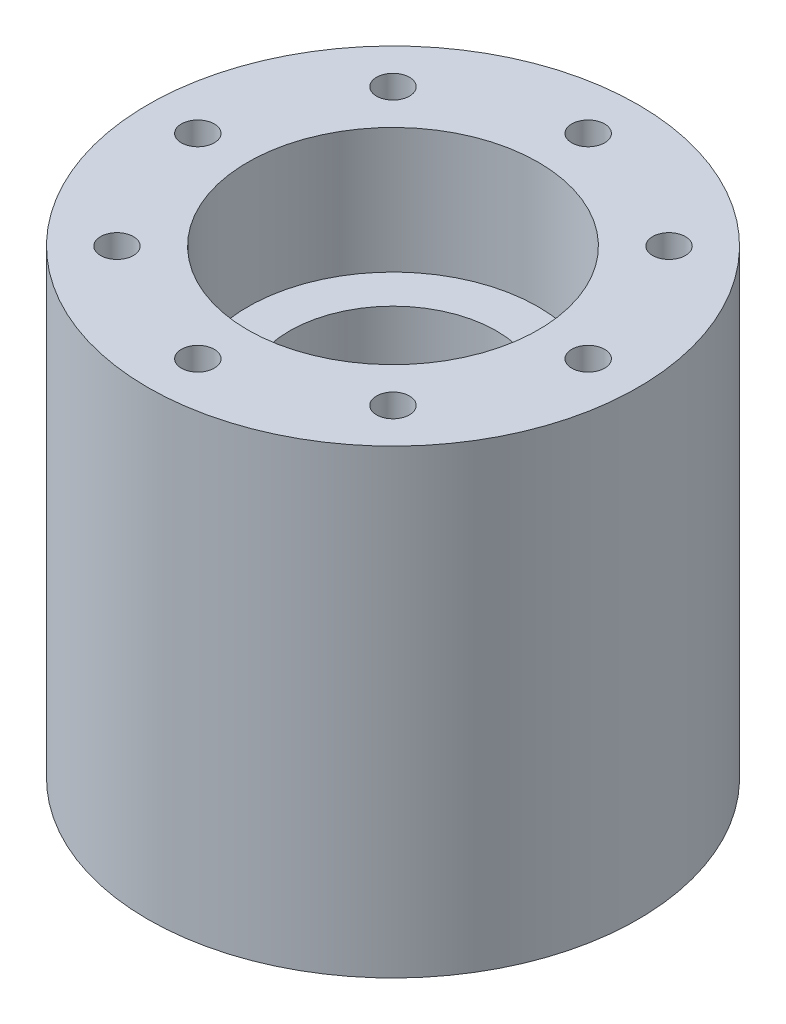
ISO-10303-21;
HEADER;
FILE_DESCRIPTION(('STEP AP214'),'2;1');
FILE_NAME('part.step','',(''),(''),'','','');
FILE_SCHEMA(('AUTOMOTIVE_DESIGN { 1 0 10303 214 1 1 1 1 }'));
ENDSEC;
DATA;
#1=APPLICATION_CONTEXT('core data for automotive mechanical design processes');
#2=APPLICATION_PROTOCOL_DEFINITION('international standard','automotive_design',2000,#1);
#3=PRODUCT_CONTEXT('',#1,'mechanical');
#4=PRODUCT('Part','Part','',(#3));
#5=PRODUCT_RELATED_PRODUCT_CATEGORY('part','',(#4));
#6=PRODUCT_DEFINITION_FORMATION('','',#4);
#7=PRODUCT_DEFINITION_CONTEXT('part definition',#1,'design');
#8=PRODUCT_DEFINITION('design','',#6,#7);
#9=PRODUCT_DEFINITION_SHAPE('','',#8);
#10=(LENGTH_UNIT() NAMED_UNIT(*) SI_UNIT(.MILLI.,.METRE.));
#11=(NAMED_UNIT(*) PLANE_ANGLE_UNIT() SI_UNIT($,.RADIAN.));
#12=(NAMED_UNIT(*) SI_UNIT($,.STERADIAN.) SOLID_ANGLE_UNIT());
#13=UNCERTAINTY_MEASURE_WITH_UNIT(LENGTH_MEASURE(1.E-05),#10,'distance_accuracy_value','');
#14=(GEOMETRIC_REPRESENTATION_CONTEXT(3) GLOBAL_UNCERTAINTY_ASSIGNED_CONTEXT((#13)) GLOBAL_UNIT_ASSIGNED_CONTEXT((#10,
#11,#12)) REPRESENTATION_CONTEXT('',''));
#15=CARTESIAN_POINT('',(0.,0.,0.));
#16=DIRECTION('',(0.,0.,1.));
#17=DIRECTION('',(1.,0.,0.));
#18=AXIS2_PLACEMENT_3D('',#15,#16,#17);
#19=CARTESIAN_POINT('',(0.,35.03125,0.));
#20=DIRECTION('',(0.,-1.,0.));
#21=DIRECTION('',(0.,0.,-1.));
#22=AXIS2_PLACEMENT_3D('',#19,#20,#21);
#23=CYLINDRICAL_SURFACE('',#22,18.6375);
#24=CARTESIAN_POINT('',(0.,35.03125,0.));
#25=DIRECTION('',(0.,1.,0.));
#26=DIRECTION('',(0.,0.,1.));
#27=AXIS2_PLACEMENT_3D('',#24,#25,#26);
#28=CIRCLE('',#27,18.6375);
#29=CARTESIAN_POINT('',(0.,35.03125,18.6375));
#30=VERTEX_POINT('',#29);
#31=EDGE_CURVE('E11',#30,#30,#28,.T.);
#32=ORIENTED_EDGE('',*,*,#31,.F.);
#33=EDGE_LOOP('',(#32));
#34=FACE_BOUND('',#33,.T.);
#35=CARTESIAN_POINT('',(0.,0.,0.));
#36=DIRECTION('',(0.,1.,0.));
#37=DIRECTION('',(0.,0.,1.));
#38=AXIS2_PLACEMENT_3D('',#35,#36,#37);
#39=CIRCLE('',#38,18.6375);
#40=CARTESIAN_POINT('',(0.,0.,18.6375));
#41=VERTEX_POINT('',#40);
#42=EDGE_CURVE('E42',#41,#41,#39,.T.);
#43=ORIENTED_EDGE('',*,*,#42,.T.);
#44=EDGE_LOOP('',(#43));
#45=FACE_BOUND('',#44,.T.);
#46=ADVANCED_FACE('F34',(#34,#45),#23,.T.);
#47=CARTESIAN_POINT('',(0.,35.03125,0.));
#48=DIRECTION('',(0.,1.,0.));
#49=DIRECTION('',(0.,0.,1.));
#50=AXIS2_PLACEMENT_3D('',#47,#48,#49);
#51=PLANE('',#50);
#52=CARTESIAN_POINT('',(0.,35.03125,14.843252));
#53=DIRECTION('',(0.,1.,0.));
#54=DIRECTION('',(0.,0.,1.));
#55=AXIS2_PLACEMENT_3D('',#52,#53,#54);
#56=CIRCLE('',#55,1.24999999999999);
#57=CARTESIAN_POINT('',(0.,35.03125,16.093252));
#58=VERTEX_POINT('',#57);
#59=EDGE_CURVE('E103',#58,#58,#56,.T.);
#60=ORIENTED_EDGE('',*,*,#59,.F.);
#61=EDGE_LOOP('',(#60));
#62=FACE_BOUND('',#61,.T.);
#63=CARTESIAN_POINT('',(10.4957641440608,35.03125,10.4957641440608));
#64=DIRECTION('',(0.,1.,0.));
#65=DIRECTION('',(0.,0.,1.));
#66=AXIS2_PLACEMENT_3D('',#63,#64,#65);
#67=CIRCLE('',#66,1.24999999999999);
#68=CARTESIAN_POINT('',(10.4957641440608,35.03125,11.7457641440608));
#69=VERTEX_POINT('',#68);
#70=EDGE_CURVE('E102',#69,#69,#67,.T.);
#71=ORIENTED_EDGE('',*,*,#70,.F.);
#72=EDGE_LOOP('',(#71));
#73=FACE_BOUND('',#72,.T.);
#74=CARTESIAN_POINT('',(14.843252,35.03125,0.));
#75=DIRECTION('',(0.,1.,0.));
#76=DIRECTION('',(0.,0.,1.));
#77=AXIS2_PLACEMENT_3D('',#74,#75,#76);
#78=CIRCLE('',#77,1.24999999999999);
#79=CARTESIAN_POINT('',(14.843252,35.03125,1.24999999999999));
#80=VERTEX_POINT('',#79);
#81=EDGE_CURVE('E113',#80,#80,#78,.T.);
#82=ORIENTED_EDGE('',*,*,#81,.F.);
#83=EDGE_LOOP('',(#82));
#84=FACE_BOUND('',#83,.T.);
#85=CARTESIAN_POINT('',(10.4957641440608,35.03125,-10.4957641440608));
#86=DIRECTION('',(0.,1.,0.));
#87=DIRECTION('',(0.,0.,1.));
#88=AXIS2_PLACEMENT_3D('',#85,#86,#87);
#89=CIRCLE('',#88,1.24999999999999);
#90=CARTESIAN_POINT('',(10.4957641440608,35.03125,-9.2457641440608));
#91=VERTEX_POINT('',#90);
#92=EDGE_CURVE('E119',#91,#91,#89,.T.);
#93=ORIENTED_EDGE('',*,*,#92,.F.);
#94=EDGE_LOOP('',(#93));
#95=FACE_BOUND('',#94,.T.);
#96=CARTESIAN_POINT('',(0.,35.03125,-14.843252));
#97=DIRECTION('',(0.,1.,0.));
#98=DIRECTION('',(0.,0.,1.));
#99=AXIS2_PLACEMENT_3D('',#96,#97,#98);
#100=CIRCLE('',#99,1.24999999999999);
#101=CARTESIAN_POINT('',(0.,35.03125,-13.593252));
#102=VERTEX_POINT('',#101);
#103=EDGE_CURVE('E125',#102,#102,#100,.T.);
#104=ORIENTED_EDGE('',*,*,#103,.F.);
#105=EDGE_LOOP('',(#104));
#106=FACE_BOUND('',#105,.T.);
#107=CARTESIAN_POINT('',(-10.4957641440608,35.03125,-10.4957641440608));
#108=DIRECTION('',(0.,1.,0.));
#109=DIRECTION('',(0.,0.,1.));
#110=AXIS2_PLACEMENT_3D('',#107,#108,#109);
#111=CIRCLE('',#110,1.24999999999999);
#112=CARTESIAN_POINT('',(-10.4957641440608,35.03125,-9.24576414406079));
#113=VERTEX_POINT('',#112);
#114=EDGE_CURVE('E131',#113,#113,#111,.T.);
#115=ORIENTED_EDGE('',*,*,#114,.F.);
#116=EDGE_LOOP('',(#115));
#117=FACE_BOUND('',#116,.T.);
#118=CARTESIAN_POINT('',(-14.843252,35.03125,0.));
#119=DIRECTION('',(0.,1.,0.));
#120=DIRECTION('',(0.,0.,1.));
#121=AXIS2_PLACEMENT_3D('',#118,#119,#120);
#122=CIRCLE('',#121,1.24999999999999);
#123=CARTESIAN_POINT('',(-14.843252,35.03125,1.24999999999999));
#124=VERTEX_POINT('',#123);
#125=EDGE_CURVE('E137',#124,#124,#122,.T.);
#126=ORIENTED_EDGE('',*,*,#125,.F.);
#127=EDGE_LOOP('',(#126));
#128=FACE_BOUND('',#127,.T.);
#129=CARTESIAN_POINT('',(-10.4957641440608,35.03125,10.4957641440608));
#130=DIRECTION('',(0.,1.,0.));
#131=DIRECTION('',(0.,0.,1.));
#132=AXIS2_PLACEMENT_3D('',#129,#130,#131);
#133=CIRCLE('',#132,1.24999999999999);
#134=CARTESIAN_POINT('',(-10.4957641440608,35.03125,11.7457641440608));
#135=VERTEX_POINT('',#134);
#136=EDGE_CURVE('E143',#135,#135,#133,.T.);
#137=ORIENTED_EDGE('',*,*,#136,.F.);
#138=EDGE_LOOP('',(#137));
#139=FACE_BOUND('',#138,.T.);
#140=CARTESIAN_POINT('',(0.,35.03125,0.));
#141=DIRECTION('',(0.,1.,0.));
#142=DIRECTION('',(0.,0.,1.));
#143=AXIS2_PLACEMENT_3D('',#140,#141,#142);
#144=CIRCLE('',#143,11.049);
#145=CARTESIAN_POINT('',(0.,35.03125,11.049));
#146=VERTEX_POINT('',#145);
#147=EDGE_CURVE('E200',#146,#146,#144,.T.);
#148=ORIENTED_EDGE('',*,*,#147,.F.);
#149=EDGE_LOOP('',(#148));
#150=FACE_BOUND('',#149,.T.);
#151=ORIENTED_EDGE('',*,*,#31,.T.);
#152=EDGE_LOOP('',(#151));
#153=FACE_BOUND('',#152,.T.);
#154=ADVANCED_FACE('F218',(#62,#73,#84,#95,#106,#117,#128,#139,#150,#153),#51,.T.);
#155=CARTESIAN_POINT('',(0.,0.,0.));
#156=DIRECTION('',(0.,1.,0.));
#157=DIRECTION('',(0.,0.,1.));
#158=AXIS2_PLACEMENT_3D('',#155,#156,#157);
#159=PLANE('',#158);
#160=CARTESIAN_POINT('',(0.,0.,14.843252));
#161=DIRECTION('',(0.,-1.,0.));
#162=DIRECTION('',(0.,0.,-1.));
#163=AXIS2_PLACEMENT_3D('',#160,#161,#162);
#164=CIRCLE('',#163,1.25);
#165=CARTESIAN_POINT('',(0.,0.,13.593252));
#166=VERTEX_POINT('',#165);
#167=EDGE_CURVE('E149',#166,#166,#164,.T.);
#168=ORIENTED_EDGE('',*,*,#167,.F.);
#169=EDGE_LOOP('',(#168));
#170=FACE_BOUND('',#169,.T.);
#171=CARTESIAN_POINT('',(10.4957641440608,0.,10.4957641440608));
#172=DIRECTION('',(0.,-1.,0.));
#173=DIRECTION('',(0.,0.,-1.));
#174=AXIS2_PLACEMENT_3D('',#171,#172,#173);
#175=CIRCLE('',#174,1.25);
#176=CARTESIAN_POINT('',(10.4957641440608,0.,9.24576414406078));
#177=VERTEX_POINT('',#176);
#178=EDGE_CURVE('E155',#177,#177,#175,.T.);
#179=ORIENTED_EDGE('',*,*,#178,.F.);
#180=EDGE_LOOP('',(#179));
#181=FACE_BOUND('',#180,.T.);
#182=CARTESIAN_POINT('',(14.843252,0.,0.));
#183=DIRECTION('',(0.,-1.,0.));
#184=DIRECTION('',(0.,0.,-1.));
#185=AXIS2_PLACEMENT_3D('',#182,#183,#184);
#186=CIRCLE('',#185,1.25);
#187=CARTESIAN_POINT('',(14.843252,0.,-1.25));
#188=VERTEX_POINT('',#187);
#189=EDGE_CURVE('E161',#188,#188,#186,.T.);
#190=ORIENTED_EDGE('',*,*,#189,.F.);
#191=EDGE_LOOP('',(#190));
#192=FACE_BOUND('',#191,.T.);
#193=CARTESIAN_POINT('',(10.4957641440608,0.,-10.4957641440608));
#194=DIRECTION('',(0.,-1.,0.));
#195=DIRECTION('',(0.,0.,-1.));
#196=AXIS2_PLACEMENT_3D('',#193,#194,#195);
#197=CIRCLE('',#196,1.25);
#198=CARTESIAN_POINT('',(10.4957641440608,0.,-11.7457641440608));
#199=VERTEX_POINT('',#198);
#200=EDGE_CURVE('E167',#199,#199,#197,.T.);
#201=ORIENTED_EDGE('',*,*,#200,.F.);
#202=EDGE_LOOP('',(#201));
#203=FACE_BOUND('',#202,.T.);
#204=CARTESIAN_POINT('',(0.,0.,-14.843252));
#205=DIRECTION('',(0.,-1.,0.));
#206=DIRECTION('',(0.,0.,-1.));
#207=AXIS2_PLACEMENT_3D('',#204,#205,#206);
#208=CIRCLE('',#207,1.25);
#209=CARTESIAN_POINT('',(0.,0.,-16.093252));
#210=VERTEX_POINT('',#209);
#211=EDGE_CURVE('E173',#210,#210,#208,.T.);
#212=ORIENTED_EDGE('',*,*,#211,.F.);
#213=EDGE_LOOP('',(#212));
#214=FACE_BOUND('',#213,.T.);
#215=CARTESIAN_POINT('',(-10.4957641440608,0.,-10.4957641440608));
#216=DIRECTION('',(0.,-1.,0.));
#217=DIRECTION('',(0.,0.,-1.));
#218=AXIS2_PLACEMENT_3D('',#215,#216,#217);
#219=CIRCLE('',#218,1.25);
#220=CARTESIAN_POINT('',(-10.4957641440608,0.,-11.7457641440608));
#221=VERTEX_POINT('',#220);
#222=EDGE_CURVE('E179',#221,#221,#219,.T.);
#223=ORIENTED_EDGE('',*,*,#222,.F.);
#224=EDGE_LOOP('',(#223));
#225=FACE_BOUND('',#224,.T.);
#226=CARTESIAN_POINT('',(-14.843252,0.,0.));
#227=DIRECTION('',(0.,-1.,0.));
#228=DIRECTION('',(0.,0.,-1.));
#229=AXIS2_PLACEMENT_3D('',#226,#227,#228);
#230=CIRCLE('',#229,1.25);
#231=CARTESIAN_POINT('',(-14.843252,0.,-1.25));
#232=VERTEX_POINT('',#231);
#233=EDGE_CURVE('E185',#232,#232,#230,.T.);
#234=ORIENTED_EDGE('',*,*,#233,.F.);
#235=EDGE_LOOP('',(#234));
#236=FACE_BOUND('',#235,.T.);
#237=CARTESIAN_POINT('',(-10.4957641440608,0.,10.4957641440608));
#238=DIRECTION('',(0.,-1.,0.));
#239=DIRECTION('',(0.,0.,-1.));
#240=AXIS2_PLACEMENT_3D('',#237,#238,#239);
#241=CIRCLE('',#240,1.25);
#242=CARTESIAN_POINT('',(-10.4957641440608,0.,9.24576414406079));
#243=VERTEX_POINT('',#242);
#244=EDGE_CURVE('E191',#243,#243,#241,.T.);
#245=ORIENTED_EDGE('',*,*,#244,.F.);
#246=EDGE_LOOP('',(#245));
#247=FACE_BOUND('',#246,.T.);
#248=CARTESIAN_POINT('',(0.,0.,0.));
#249=DIRECTION('',(0.,-1.,0.));
#250=DIRECTION('',(0.,0.,-1.));
#251=AXIS2_PLACEMENT_3D('',#248,#249,#250);
#252=CIRCLE('',#251,11.049);
#253=CARTESIAN_POINT('',(0.,0.,-11.049));
#254=VERTEX_POINT('',#253);
#255=EDGE_CURVE('E204',#254,#254,#252,.T.);
#256=ORIENTED_EDGE('',*,*,#255,.F.);
#257=EDGE_LOOP('',(#256));
#258=FACE_BOUND('',#257,.T.);
#259=ORIENTED_EDGE('',*,*,#42,.F.);
#260=EDGE_LOOP('',(#259));
#261=FACE_BOUND('',#260,.T.);
#262=ADVANCED_FACE('F215',(#170,#181,#192,#203,#214,#225,#236,#247,#258,#261),#159,.F.);
#263=CARTESIAN_POINT('',(0.,9.525,0.));
#264=DIRECTION('',(0.,-1.,0.));
#265=DIRECTION('',(0.,0.,-1.));
#266=AXIS2_PLACEMENT_3D('',#263,#264,#265);
#267=CYLINDRICAL_SURFACE('',#266,11.049);
#268=CARTESIAN_POINT('',(0.,9.525,0.));
#269=DIRECTION('',(0.,-1.,0.));
#270=DIRECTION('',(0.,0.,-1.));
#271=AXIS2_PLACEMENT_3D('',#268,#269,#270);
#272=CIRCLE('',#271,11.049);
#273=CARTESIAN_POINT('',(0.,9.525,-11.049));
#274=VERTEX_POINT('',#273);
#275=EDGE_CURVE('E207',#274,#274,#272,.T.);
#276=ORIENTED_EDGE('',*,*,#275,.F.);
#277=EDGE_LOOP('',(#276));
#278=FACE_BOUND('',#277,.T.);
#279=ORIENTED_EDGE('',*,*,#255,.T.);
#280=EDGE_LOOP('',(#279));
#281=FACE_BOUND('',#280,.T.);
#282=ADVANCED_FACE('F217',(#278,#281),#267,.F.);
#283=CARTESIAN_POINT('',(0.,9.525,0.));
#284=DIRECTION('',(0.,-1.,0.));
#285=DIRECTION('',(0.,0.,-1.));
#286=AXIS2_PLACEMENT_3D('',#283,#284,#285);
#287=PLANE('',#286);
#288=CARTESIAN_POINT('',(0.,9.525,0.));
#289=DIRECTION('',(0.,-1.,0.));
#290=DIRECTION('',(0.,0.,-1.));
#291=AXIS2_PLACEMENT_3D('',#288,#289,#290);
#292=CIRCLE('',#291,7.874);
#293=CARTESIAN_POINT('',(0.,9.525,-7.874));
#294=VERTEX_POINT('',#293);
#295=EDGE_CURVE('E197',#294,#294,#292,.T.);
#296=ORIENTED_EDGE('',*,*,#295,.F.);
#297=EDGE_LOOP('',(#296));
#298=FACE_BOUND('',#297,.T.);
#299=ORIENTED_EDGE('',*,*,#275,.T.);
#300=EDGE_LOOP('',(#299));
#301=FACE_BOUND('',#300,.T.);
#302=ADVANCED_FACE('F224',(#298,#301),#287,.T.);
#303=CARTESIAN_POINT('',(0.,25.50625,0.));
#304=DIRECTION('',(0.,1.,0.));
#305=DIRECTION('',(0.,0.,1.));
#306=AXIS2_PLACEMENT_3D('',#303,#304,#305);
#307=CYLINDRICAL_SURFACE('',#306,11.049);
#308=CARTESIAN_POINT('',(0.,25.50625,0.));
#309=DIRECTION('',(0.,1.,0.));
#310=DIRECTION('',(0.,0.,1.));
#311=AXIS2_PLACEMENT_3D('',#308,#309,#310);
#312=CIRCLE('',#311,11.049);
#313=CARTESIAN_POINT('',(0.,25.50625,11.049));
#314=VERTEX_POINT('',#313);
#315=EDGE_CURVE('E201',#314,#314,#312,.T.);
#316=ORIENTED_EDGE('',*,*,#315,.F.);
#317=EDGE_LOOP('',(#316));
#318=FACE_BOUND('',#317,.T.);
#319=ORIENTED_EDGE('',*,*,#147,.T.);
#320=EDGE_LOOP('',(#319));
#321=FACE_BOUND('',#320,.T.);
#322=ADVANCED_FACE('F584',(#318,#321),#307,.F.);
#323=CARTESIAN_POINT('',(0.,25.50625,0.));
#324=DIRECTION('',(0.,1.,0.));
#325=DIRECTION('',(0.,0.,1.));
#326=AXIS2_PLACEMENT_3D('',#323,#324,#325);
#327=PLANE('',#326);
#328=CARTESIAN_POINT('',(0.,25.50625,0.));
#329=DIRECTION('',(0.,1.,0.));
#330=DIRECTION('',(0.,0.,1.));
#331=AXIS2_PLACEMENT_3D('',#328,#329,#330);
#332=CIRCLE('',#331,7.874);
#333=CARTESIAN_POINT('',(0.,25.50625,7.874));
#334=VERTEX_POINT('',#333);
#335=EDGE_CURVE('E37',#334,#334,#332,.T.);
#336=ORIENTED_EDGE('',*,*,#335,.F.);
#337=EDGE_LOOP('',(#336));
#338=FACE_BOUND('',#337,.T.);
#339=ORIENTED_EDGE('',*,*,#315,.T.);
#340=EDGE_LOOP('',(#339));
#341=FACE_BOUND('',#340,.T.);
#342=ADVANCED_FACE('F580',(#338,#341),#327,.T.);
#343=CARTESIAN_POINT('',(0.,35.03125,0.));
#344=DIRECTION('',(0.,-1.,0.));
#345=DIRECTION('',(0.,0.,-1.));
#346=AXIS2_PLACEMENT_3D('',#343,#344,#345);
#347=CYLINDRICAL_SURFACE('',#346,7.874);
#348=ORIENTED_EDGE('',*,*,#295,.T.);
#349=EDGE_LOOP('',(#348));
#350=FACE_BOUND('',#349,.T.);
#351=ORIENTED_EDGE('',*,*,#335,.T.);
#352=EDGE_LOOP('',(#351));
#353=FACE_BOUND('',#352,.T.);
#354=ADVANCED_FACE('F578',(#350,#353),#347,.F.);
#355=CARTESIAN_POINT('',(-10.4957641440608,7.50062,10.4957641440608));
#356=DIRECTION('',(0.,-1.,0.));
#357=DIRECTION('',(0.,0.,-1.));
#358=AXIS2_PLACEMENT_3D('',#355,#356,#357);
#359=CONICAL_SURFACE('',#358,1.25,1.02974425867665);
#360=CARTESIAN_POINT('',(-10.4957641440608,8.25169577378445,10.4957641440608));
#361=VERTEX_POINT('',#360);
#362=VERTEX_LOOP('',#361);
#363=FACE_BOUND('',#362,.T.);
#364=CARTESIAN_POINT('',(-10.4957641440608,7.50062,10.4957641440608));
#365=DIRECTION('',(0.,-1.,0.));
#366=DIRECTION('',(0.,0.,-1.));
#367=AXIS2_PLACEMENT_3D('',#364,#365,#366);
#368=CIRCLE('',#367,1.25);
#369=CARTESIAN_POINT('',(-10.4957641440608,7.50062,9.24576414406079));
#370=VERTEX_POINT('',#369);
#371=EDGE_CURVE('E194',#370,#370,#368,.T.);
#372=ORIENTED_EDGE('',*,*,#371,.T.);
#373=EDGE_LOOP('',(#372));
#374=FACE_BOUND('',#373,.T.);
#375=ADVANCED_FACE('F505',(#363,#374),#359,.F.);
#376=CARTESIAN_POINT('',(-10.4957641440608,0.,10.4957641440608));
#377=DIRECTION('',(0.,-1.,0.));
#378=DIRECTION('',(0.,0.,-1.));
#379=AXIS2_PLACEMENT_3D('',#376,#377,#378);
#380=CYLINDRICAL_SURFACE('',#379,1.25);
#381=ORIENTED_EDGE('',*,*,#371,.F.);
#382=EDGE_LOOP('',(#381));
#383=FACE_BOUND('',#382,.T.);
#384=ORIENTED_EDGE('',*,*,#244,.T.);
#385=EDGE_LOOP('',(#384));
#386=FACE_BOUND('',#385,.T.);
#387=ADVANCED_FACE('F501',(#383,#386),#380,.F.);
#388=CARTESIAN_POINT('',(-14.843252,7.50062,0.));
#389=DIRECTION('',(0.,-1.,0.));
#390=DIRECTION('',(0.,0.,-1.));
#391=AXIS2_PLACEMENT_3D('',#388,#389,#390);
#392=CONICAL_SURFACE('',#391,1.25,1.02974425867665);
#393=CARTESIAN_POINT('',(-14.843252,8.25169577378445,0.));
#394=VERTEX_POINT('',#393);
#395=VERTEX_LOOP('',#394);
#396=FACE_BOUND('',#395,.T.);
#397=CARTESIAN_POINT('',(-14.843252,7.50062,0.));
#398=DIRECTION('',(0.,-1.,0.));
#399=DIRECTION('',(0.,0.,-1.));
#400=AXIS2_PLACEMENT_3D('',#397,#398,#399);
#401=CIRCLE('',#400,1.25);
#402=CARTESIAN_POINT('',(-14.843252,7.50062,-1.25));
#403=VERTEX_POINT('',#402);
#404=EDGE_CURVE('E188',#403,#403,#401,.T.);
#405=ORIENTED_EDGE('',*,*,#404,.T.);
#406=EDGE_LOOP('',(#405));
#407=FACE_BOUND('',#406,.T.);
#408=ADVANCED_FACE('F493',(#396,#407),#392,.F.);
#409=CARTESIAN_POINT('',(-14.843252,0.,0.));
#410=DIRECTION('',(0.,-1.,0.));
#411=DIRECTION('',(0.,0.,-1.));
#412=AXIS2_PLACEMENT_3D('',#409,#410,#411);
#413=CYLINDRICAL_SURFACE('',#412,1.25);
#414=ORIENTED_EDGE('',*,*,#404,.F.);
#415=EDGE_LOOP('',(#414));
#416=FACE_BOUND('',#415,.T.);
#417=ORIENTED_EDGE('',*,*,#233,.T.);
#418=EDGE_LOOP('',(#417));
#419=FACE_BOUND('',#418,.T.);
#420=ADVANCED_FACE('F488',(#416,#419),#413,.F.);
#421=CARTESIAN_POINT('',(-10.4957641440608,7.50062,-10.4957641440608));
#422=DIRECTION('',(0.,-1.,0.));
#423=DIRECTION('',(0.,0.,-1.));
#424=AXIS2_PLACEMENT_3D('',#421,#422,#423);
#425=CONICAL_SURFACE('',#424,1.25,1.02974425867665);
#426=CARTESIAN_POINT('',(-10.4957641440608,8.25169577378445,-10.4957641440608));
#427=VERTEX_POINT('',#426);
#428=VERTEX_LOOP('',#427);
#429=FACE_BOUND('',#428,.T.);
#430=CARTESIAN_POINT('',(-10.4957641440608,7.50062,-10.4957641440608));
#431=DIRECTION('',(0.,-1.,0.));
#432=DIRECTION('',(0.,0.,-1.));
#433=AXIS2_PLACEMENT_3D('',#430,#431,#432);
#434=CIRCLE('',#433,1.25);
#435=CARTESIAN_POINT('',(-10.4957641440608,7.50062,-11.7457641440608));
#436=VERTEX_POINT('',#435);
#437=EDGE_CURVE('E182',#436,#436,#434,.T.);
#438=ORIENTED_EDGE('',*,*,#437,.T.);
#439=EDGE_LOOP('',(#438));
#440=FACE_BOUND('',#439,.T.);
#441=ADVANCED_FACE('F480',(#429,#440),#425,.F.);
#442=CARTESIAN_POINT('',(-10.4957641440608,0.,-10.4957641440608));
#443=DIRECTION('',(0.,-1.,0.));
#444=DIRECTION('',(0.,0.,-1.));
#445=AXIS2_PLACEMENT_3D('',#442,#443,#444);
#446=CYLINDRICAL_SURFACE('',#445,1.25);
#447=ORIENTED_EDGE('',*,*,#437,.F.);
#448=EDGE_LOOP('',(#447));
#449=FACE_BOUND('',#448,.T.);
#450=ORIENTED_EDGE('',*,*,#222,.T.);
#451=EDGE_LOOP('',(#450));
#452=FACE_BOUND('',#451,.T.);
#453=ADVANCED_FACE('F475',(#449,#452),#446,.F.);
#454=CARTESIAN_POINT('',(0.,7.50062,-14.843252));
#455=DIRECTION('',(0.,-1.,0.));
#456=DIRECTION('',(0.,0.,-1.));
#457=AXIS2_PLACEMENT_3D('',#454,#455,#456);
#458=CONICAL_SURFACE('',#457,1.25,1.02974425867665);
#459=CARTESIAN_POINT('',(0.,8.25169577378445,-14.843252));
#460=VERTEX_POINT('',#459);
#461=VERTEX_LOOP('',#460);
#462=FACE_BOUND('',#461,.T.);
#463=CARTESIAN_POINT('',(0.,7.50062,-14.843252));
#464=DIRECTION('',(0.,-1.,0.));
#465=DIRECTION('',(0.,0.,-1.));
#466=AXIS2_PLACEMENT_3D('',#463,#464,#465);
#467=CIRCLE('',#466,1.25);
#468=CARTESIAN_POINT('',(0.,7.50062,-16.093252));
#469=VERTEX_POINT('',#468);
#470=EDGE_CURVE('E176',#469,#469,#467,.T.);
#471=ORIENTED_EDGE('',*,*,#470,.T.);
#472=EDGE_LOOP('',(#471));
#473=FACE_BOUND('',#472,.T.);
#474=ADVANCED_FACE('F467',(#462,#473),#458,.F.);
#475=CARTESIAN_POINT('',(0.,0.,-14.843252));
#476=DIRECTION('',(0.,-1.,0.));
#477=DIRECTION('',(0.,0.,-1.));
#478=AXIS2_PLACEMENT_3D('',#475,#476,#477);
#479=CYLINDRICAL_SURFACE('',#478,1.25);
#480=ORIENTED_EDGE('',*,*,#470,.F.);
#481=EDGE_LOOP('',(#480));
#482=FACE_BOUND('',#481,.T.);
#483=ORIENTED_EDGE('',*,*,#211,.T.);
#484=EDGE_LOOP('',(#483));
#485=FACE_BOUND('',#484,.T.);
#486=ADVANCED_FACE('F462',(#482,#485),#479,.F.);
#487=CARTESIAN_POINT('',(10.4957641440608,7.50062,-10.4957641440608));
#488=DIRECTION('',(0.,-1.,0.));
#489=DIRECTION('',(0.,0.,-1.));
#490=AXIS2_PLACEMENT_3D('',#487,#488,#489);
#491=CONICAL_SURFACE('',#490,1.25,1.02974425867665);
#492=CARTESIAN_POINT('',(10.4957641440608,8.25169577378445,-10.4957641440608));
#493=VERTEX_POINT('',#492);
#494=VERTEX_LOOP('',#493);
#495=FACE_BOUND('',#494,.T.);
#496=CARTESIAN_POINT('',(10.4957641440608,7.50062,-10.4957641440608));
#497=DIRECTION('',(0.,-1.,0.));
#498=DIRECTION('',(0.,0.,-1.));
#499=AXIS2_PLACEMENT_3D('',#496,#497,#498);
#500=CIRCLE('',#499,1.25);
#501=CARTESIAN_POINT('',(10.4957641440608,7.50062,-11.7457641440608));
#502=VERTEX_POINT('',#501);
#503=EDGE_CURVE('E170',#502,#502,#500,.T.);
#504=ORIENTED_EDGE('',*,*,#503,.T.);
#505=EDGE_LOOP('',(#504));
#506=FACE_BOUND('',#505,.T.);
#507=ADVANCED_FACE('F454',(#495,#506),#491,.F.);
#508=CARTESIAN_POINT('',(10.4957641440608,0.,-10.4957641440608));
#509=DIRECTION('',(0.,-1.,0.));
#510=DIRECTION('',(0.,0.,-1.));
#511=AXIS2_PLACEMENT_3D('',#508,#509,#510);
#512=CYLINDRICAL_SURFACE('',#511,1.25);
#513=ORIENTED_EDGE('',*,*,#503,.F.);
#514=EDGE_LOOP('',(#513));
#515=FACE_BOUND('',#514,.T.);
#516=ORIENTED_EDGE('',*,*,#200,.T.);
#517=EDGE_LOOP('',(#516));
#518=FACE_BOUND('',#517,.T.);
#519=ADVANCED_FACE('F449',(#515,#518),#512,.F.);
#520=CARTESIAN_POINT('',(14.843252,7.50062,0.));
#521=DIRECTION('',(0.,-1.,0.));
#522=DIRECTION('',(0.,0.,-1.));
#523=AXIS2_PLACEMENT_3D('',#520,#521,#522);
#524=CONICAL_SURFACE('',#523,1.25,1.02974425867665);
#525=CARTESIAN_POINT('',(14.843252,8.25169577378445,0.));
#526=VERTEX_POINT('',#525);
#527=VERTEX_LOOP('',#526);
#528=FACE_BOUND('',#527,.T.);
#529=CARTESIAN_POINT('',(14.843252,7.50062,0.));
#530=DIRECTION('',(0.,-1.,0.));
#531=DIRECTION('',(0.,0.,-1.));
#532=AXIS2_PLACEMENT_3D('',#529,#530,#531);
#533=CIRCLE('',#532,1.25);
#534=CARTESIAN_POINT('',(14.843252,7.50062,-1.25));
#535=VERTEX_POINT('',#534);
#536=EDGE_CURVE('E164',#535,#535,#533,.T.);
#537=ORIENTED_EDGE('',*,*,#536,.T.);
#538=EDGE_LOOP('',(#537));
#539=FACE_BOUND('',#538,.T.);
#540=ADVANCED_FACE('F441',(#528,#539),#524,.F.);
#541=CARTESIAN_POINT('',(14.843252,0.,0.));
#542=DIRECTION('',(0.,-1.,0.));
#543=DIRECTION('',(0.,0.,-1.));
#544=AXIS2_PLACEMENT_3D('',#541,#542,#543);
#545=CYLINDRICAL_SURFACE('',#544,1.25);
#546=ORIENTED_EDGE('',*,*,#536,.F.);
#547=EDGE_LOOP('',(#546));
#548=FACE_BOUND('',#547,.T.);
#549=ORIENTED_EDGE('',*,*,#189,.T.);
#550=EDGE_LOOP('',(#549));
#551=FACE_BOUND('',#550,.T.);
#552=ADVANCED_FACE('F436',(#548,#551),#545,.F.);
#553=CARTESIAN_POINT('',(10.4957641440608,7.50062,10.4957641440608));
#554=DIRECTION('',(0.,-1.,0.));
#555=DIRECTION('',(0.,0.,-1.));
#556=AXIS2_PLACEMENT_3D('',#553,#554,#555);
#557=CONICAL_SURFACE('',#556,1.25,1.02974425867665);
#558=CARTESIAN_POINT('',(10.4957641440608,8.25169577378445,10.4957641440608));
#559=VERTEX_POINT('',#558);
#560=VERTEX_LOOP('',#559);
#561=FACE_BOUND('',#560,.T.);
#562=CARTESIAN_POINT('',(10.4957641440608,7.50062,10.4957641440608));
#563=DIRECTION('',(0.,-1.,0.));
#564=DIRECTION('',(0.,0.,-1.));
#565=AXIS2_PLACEMENT_3D('',#562,#563,#564);
#566=CIRCLE('',#565,1.25);
#567=CARTESIAN_POINT('',(10.4957641440608,7.50062,9.24576414406079));
#568=VERTEX_POINT('',#567);
#569=EDGE_CURVE('E158',#568,#568,#566,.T.);
#570=ORIENTED_EDGE('',*,*,#569,.T.);
#571=EDGE_LOOP('',(#570));
#572=FACE_BOUND('',#571,.T.);
#573=ADVANCED_FACE('F428',(#561,#572),#557,.F.);
#574=CARTESIAN_POINT('',(10.4957641440608,0.,10.4957641440608));
#575=DIRECTION('',(0.,-1.,0.));
#576=DIRECTION('',(0.,0.,-1.));
#577=AXIS2_PLACEMENT_3D('',#574,#575,#576);
#578=CYLINDRICAL_SURFACE('',#577,1.25);
#579=ORIENTED_EDGE('',*,*,#569,.F.);
#580=EDGE_LOOP('',(#579));
#581=FACE_BOUND('',#580,.T.);
#582=ORIENTED_EDGE('',*,*,#178,.T.);
#583=EDGE_LOOP('',(#582));
#584=FACE_BOUND('',#583,.T.);
#585=ADVANCED_FACE('F423',(#581,#584),#578,.F.);
#586=CARTESIAN_POINT('',(0.,7.50062,14.843252));
#587=DIRECTION('',(0.,-1.,0.));
#588=DIRECTION('',(0.,0.,-1.));
#589=AXIS2_PLACEMENT_3D('',#586,#587,#588);
#590=CONICAL_SURFACE('',#589,1.25,1.02974425867665);
#591=CARTESIAN_POINT('',(0.,8.25169577378445,14.843252));
#592=VERTEX_POINT('',#591);
#593=VERTEX_LOOP('',#592);
#594=FACE_BOUND('',#593,.T.);
#595=CARTESIAN_POINT('',(0.,7.50062,14.843252));
#596=DIRECTION('',(0.,-1.,0.));
#597=DIRECTION('',(0.,0.,-1.));
#598=AXIS2_PLACEMENT_3D('',#595,#596,#597);
#599=CIRCLE('',#598,1.25);
#600=CARTESIAN_POINT('',(0.,7.50062,13.593252));
#601=VERTEX_POINT('',#600);
#602=EDGE_CURVE('E152',#601,#601,#599,.T.);
#603=ORIENTED_EDGE('',*,*,#602,.T.);
#604=EDGE_LOOP('',(#603));
#605=FACE_BOUND('',#604,.T.);
#606=ADVANCED_FACE('F418',(#594,#605),#590,.F.);
#607=CARTESIAN_POINT('',(0.,0.,14.843252));
#608=DIRECTION('',(0.,-1.,0.));
#609=DIRECTION('',(0.,0.,-1.));
#610=AXIS2_PLACEMENT_3D('',#607,#608,#609);
#611=CYLINDRICAL_SURFACE('',#610,1.25);
#612=ORIENTED_EDGE('',*,*,#602,.F.);
#613=EDGE_LOOP('',(#612));
#614=FACE_BOUND('',#613,.T.);
#615=ORIENTED_EDGE('',*,*,#167,.T.);
#616=EDGE_LOOP('',(#615));
#617=FACE_BOUND('',#616,.T.);
#618=ADVANCED_FACE('F249',(#614,#617),#611,.F.);
#619=CARTESIAN_POINT('',(-10.4957641440608,27.53063,10.4957641440608));
#620=DIRECTION('',(0.,1.,0.));
#621=DIRECTION('',(0.,0.,1.));
#622=AXIS2_PLACEMENT_3D('',#619,#620,#621);
#623=CONICAL_SURFACE('',#622,1.24999999999999,1.02974425867665);
#624=CARTESIAN_POINT('',(-10.4957641440608,26.7795542262156,10.4957641440608));
#625=VERTEX_POINT('',#624);
#626=VERTEX_LOOP('',#625);
#627=FACE_BOUND('',#626,.T.);
#628=CARTESIAN_POINT('',(-10.4957641440608,27.53063,10.4957641440608));
#629=DIRECTION('',(0.,1.,0.));
#630=DIRECTION('',(0.,0.,1.));
#631=AXIS2_PLACEMENT_3D('',#628,#629,#630);
#632=CIRCLE('',#631,1.24999999999999);
#633=CARTESIAN_POINT('',(-10.4957641440608,27.53063,11.7457641440608));
#634=VERTEX_POINT('',#633);
#635=EDGE_CURVE('E146',#634,#634,#632,.T.);
#636=ORIENTED_EDGE('',*,*,#635,.T.);
#637=EDGE_LOOP('',(#636));
#638=FACE_BOUND('',#637,.T.);
#639=ADVANCED_FACE('F254',(#627,#638),#623,.F.);
#640=CARTESIAN_POINT('',(-10.4957641440608,35.03125,10.4957641440608));
#641=DIRECTION('',(0.,1.,0.));
#642=DIRECTION('',(0.,0.,1.));
#643=AXIS2_PLACEMENT_3D('',#640,#641,#642);
#644=CYLINDRICAL_SURFACE('',#643,1.24999999999999);
#645=ORIENTED_EDGE('',*,*,#635,.F.);
#646=EDGE_LOOP('',(#645));
#647=FACE_BOUND('',#646,.T.);
#648=ORIENTED_EDGE('',*,*,#136,.T.);
#649=EDGE_LOOP('',(#648));
#650=FACE_BOUND('',#649,.T.);
#651=ADVANCED_FACE('F259',(#647,#650),#644,.F.);
#652=CARTESIAN_POINT('',(-14.843252,27.53063,0.));
#653=DIRECTION('',(0.,1.,0.));
#654=DIRECTION('',(0.,0.,1.));
#655=AXIS2_PLACEMENT_3D('',#652,#653,#654);
#656=CONICAL_SURFACE('',#655,1.24999999999999,1.02974425867665);
#657=CARTESIAN_POINT('',(-14.843252,26.7795542262156,0.));
#658=VERTEX_POINT('',#657);
#659=VERTEX_LOOP('',#658);
#660=FACE_BOUND('',#659,.T.);
#661=CARTESIAN_POINT('',(-14.843252,27.53063,0.));
#662=DIRECTION('',(0.,1.,0.));
#663=DIRECTION('',(0.,0.,1.));
#664=AXIS2_PLACEMENT_3D('',#661,#662,#663);
#665=CIRCLE('',#664,1.24999999999999);
#666=CARTESIAN_POINT('',(-14.843252,27.53063,1.24999999999999));
#667=VERTEX_POINT('',#666);
#668=EDGE_CURVE('E140',#667,#667,#665,.T.);
#669=ORIENTED_EDGE('',*,*,#668,.T.);
#670=EDGE_LOOP('',(#669));
#671=FACE_BOUND('',#670,.T.);
#672=ADVANCED_FACE('F271',(#660,#671),#656,.F.);
#673=CARTESIAN_POINT('',(-14.843252,35.03125,0.));
#674=DIRECTION('',(0.,1.,0.));
#675=DIRECTION('',(0.,0.,1.));
#676=AXIS2_PLACEMENT_3D('',#673,#674,#675);
#677=CYLINDRICAL_SURFACE('',#676,1.24999999999999);
#678=ORIENTED_EDGE('',*,*,#668,.F.);
#679=EDGE_LOOP('',(#678));
#680=FACE_BOUND('',#679,.T.);
#681=ORIENTED_EDGE('',*,*,#125,.T.);
#682=EDGE_LOOP('',(#681));
#683=FACE_BOUND('',#682,.T.);
#684=ADVANCED_FACE('F282',(#680,#683),#677,.F.);
#685=CARTESIAN_POINT('',(-10.4957641440608,27.53063,-10.4957641440608));
#686=DIRECTION('',(0.,1.,0.));
#687=DIRECTION('',(0.,0.,1.));
#688=AXIS2_PLACEMENT_3D('',#685,#686,#687);
#689=CONICAL_SURFACE('',#688,1.24999999999999,1.02974425867665);
#690=CARTESIAN_POINT('',(-10.4957641440608,26.7795542262156,-10.4957641440608));
#691=VERTEX_POINT('',#690);
#692=VERTEX_LOOP('',#691);
#693=FACE_BOUND('',#692,.T.);
#694=CARTESIAN_POINT('',(-10.4957641440608,27.53063,-10.4957641440608));
#695=DIRECTION('',(0.,1.,0.));
#696=DIRECTION('',(0.,0.,1.));
#697=AXIS2_PLACEMENT_3D('',#694,#695,#696);
#698=CIRCLE('',#697,1.24999999999999);
#699=CARTESIAN_POINT('',(-10.4957641440608,27.53063,-9.2457641440608));
#700=VERTEX_POINT('',#699);
#701=EDGE_CURVE('E134',#700,#700,#698,.T.);
#702=ORIENTED_EDGE('',*,*,#701,.T.);
#703=EDGE_LOOP('',(#702));
#704=FACE_BOUND('',#703,.T.);
#705=ADVANCED_FACE('F292',(#693,#704),#689,.F.);
#706=CARTESIAN_POINT('',(-10.4957641440608,35.03125,-10.4957641440608));
#707=DIRECTION('',(0.,1.,0.));
#708=DIRECTION('',(0.,0.,1.));
#709=AXIS2_PLACEMENT_3D('',#706,#707,#708);
#710=CYLINDRICAL_SURFACE('',#709,1.24999999999999);
#711=ORIENTED_EDGE('',*,*,#701,.F.);
#712=EDGE_LOOP('',(#711));
#713=FACE_BOUND('',#712,.T.);
#714=ORIENTED_EDGE('',*,*,#114,.T.);
#715=EDGE_LOOP('',(#714));
#716=FACE_BOUND('',#715,.T.);
#717=ADVANCED_FACE('F303',(#713,#716),#710,.F.);
#718=CARTESIAN_POINT('',(0.,27.53063,-14.843252));
#719=DIRECTION('',(0.,1.,0.));
#720=DIRECTION('',(0.,0.,1.));
#721=AXIS2_PLACEMENT_3D('',#718,#719,#720);
#722=CONICAL_SURFACE('',#721,1.24999999999999,1.02974425867665);
#723=CARTESIAN_POINT('',(0.,26.7795542262156,-14.843252));
#724=VERTEX_POINT('',#723);
#725=VERTEX_LOOP('',#724);
#726=FACE_BOUND('',#725,.T.);
#727=CARTESIAN_POINT('',(0.,27.53063,-14.843252));
#728=DIRECTION('',(0.,1.,0.));
#729=DIRECTION('',(0.,0.,1.));
#730=AXIS2_PLACEMENT_3D('',#727,#728,#729);
#731=CIRCLE('',#730,1.24999999999999);
#732=CARTESIAN_POINT('',(0.,27.53063,-13.593252));
#733=VERTEX_POINT('',#732);
#734=EDGE_CURVE('E128',#733,#733,#731,.T.);
#735=ORIENTED_EDGE('',*,*,#734,.T.);
#736=EDGE_LOOP('',(#735));
#737=FACE_BOUND('',#736,.T.);
#738=ADVANCED_FACE('F313',(#726,#737),#722,.F.);
#739=CARTESIAN_POINT('',(0.,35.03125,-14.843252));
#740=DIRECTION('',(0.,1.,0.));
#741=DIRECTION('',(0.,0.,1.));
#742=AXIS2_PLACEMENT_3D('',#739,#740,#741);
#743=CYLINDRICAL_SURFACE('',#742,1.24999999999999);
#744=ORIENTED_EDGE('',*,*,#734,.F.);
#745=EDGE_LOOP('',(#744));
#746=FACE_BOUND('',#745,.T.);
#747=ORIENTED_EDGE('',*,*,#103,.T.);
#748=EDGE_LOOP('',(#747));
#749=FACE_BOUND('',#748,.T.);
#750=ADVANCED_FACE('F324',(#746,#749),#743,.F.);
#751=CARTESIAN_POINT('',(10.4957641440608,27.53063,-10.4957641440608));
#752=DIRECTION('',(0.,1.,0.));
#753=DIRECTION('',(0.,0.,1.));
#754=AXIS2_PLACEMENT_3D('',#751,#752,#753);
#755=CONICAL_SURFACE('',#754,1.24999999999999,1.02974425867665);
#756=CARTESIAN_POINT('',(10.4957641440608,26.7795542262156,-10.4957641440608));
#757=VERTEX_POINT('',#756);
#758=VERTEX_LOOP('',#757);
#759=FACE_BOUND('',#758,.T.);
#760=CARTESIAN_POINT('',(10.4957641440608,27.53063,-10.4957641440608));
#761=DIRECTION('',(0.,1.,0.));
#762=DIRECTION('',(0.,0.,1.));
#763=AXIS2_PLACEMENT_3D('',#760,#761,#762);
#764=CIRCLE('',#763,1.24999999999999);
#765=CARTESIAN_POINT('',(10.4957641440608,27.53063,-9.2457641440608));
#766=VERTEX_POINT('',#765);
#767=EDGE_CURVE('E122',#766,#766,#764,.T.);
#768=ORIENTED_EDGE('',*,*,#767,.T.);
#769=EDGE_LOOP('',(#768));
#770=FACE_BOUND('',#769,.T.);
#771=ADVANCED_FACE('F334',(#759,#770),#755,.F.);
#772=CARTESIAN_POINT('',(10.4957641440608,35.03125,-10.4957641440608));
#773=DIRECTION('',(0.,1.,0.));
#774=DIRECTION('',(0.,0.,1.));
#775=AXIS2_PLACEMENT_3D('',#772,#773,#774);
#776=CYLINDRICAL_SURFACE('',#775,1.24999999999999);
#777=ORIENTED_EDGE('',*,*,#767,.F.);
#778=EDGE_LOOP('',(#777));
#779=FACE_BOUND('',#778,.T.);
#780=ORIENTED_EDGE('',*,*,#92,.T.);
#781=EDGE_LOOP('',(#780));
#782=FACE_BOUND('',#781,.T.);
#783=ADVANCED_FACE('F345',(#779,#782),#776,.F.);
#784=CARTESIAN_POINT('',(14.843252,27.53063,0.));
#785=DIRECTION('',(0.,1.,0.));
#786=DIRECTION('',(0.,0.,1.));
#787=AXIS2_PLACEMENT_3D('',#784,#785,#786);
#788=CONICAL_SURFACE('',#787,1.24999999999999,1.02974425867665);
#789=CARTESIAN_POINT('',(14.843252,26.7795542262156,0.));
#790=VERTEX_POINT('',#789);
#791=VERTEX_LOOP('',#790);
#792=FACE_BOUND('',#791,.T.);
#793=CARTESIAN_POINT('',(14.843252,27.53063,0.));
#794=DIRECTION('',(0.,1.,0.));
#795=DIRECTION('',(0.,0.,1.));
#796=AXIS2_PLACEMENT_3D('',#793,#794,#795);
#797=CIRCLE('',#796,1.24999999999999);
#798=CARTESIAN_POINT('',(14.843252,27.53063,1.24999999999999));
#799=VERTEX_POINT('',#798);
#800=EDGE_CURVE('E116',#799,#799,#797,.T.);
#801=ORIENTED_EDGE('',*,*,#800,.T.);
#802=EDGE_LOOP('',(#801));
#803=FACE_BOUND('',#802,.T.);
#804=ADVANCED_FACE('F355',(#792,#803),#788,.F.);
#805=CARTESIAN_POINT('',(14.843252,35.03125,0.));
#806=DIRECTION('',(0.,1.,0.));
#807=DIRECTION('',(0.,0.,1.));
#808=AXIS2_PLACEMENT_3D('',#805,#806,#807);
#809=CYLINDRICAL_SURFACE('',#808,1.24999999999999);
#810=ORIENTED_EDGE('',*,*,#800,.F.);
#811=EDGE_LOOP('',(#810));
#812=FACE_BOUND('',#811,.T.);
#813=ORIENTED_EDGE('',*,*,#81,.T.);
#814=EDGE_LOOP('',(#813));
#815=FACE_BOUND('',#814,.T.);
#816=ADVANCED_FACE('F366',(#812,#815),#809,.F.);
#817=CARTESIAN_POINT('',(10.4957641440608,27.53063,10.4957641440608));
#818=DIRECTION('',(0.,1.,0.));
#819=DIRECTION('',(0.,0.,1.));
#820=AXIS2_PLACEMENT_3D('',#817,#818,#819);
#821=CONICAL_SURFACE('',#820,1.24999999999999,1.02974425867665);
#822=CARTESIAN_POINT('',(10.4957641440608,26.7795542262156,10.4957641440608));
#823=VERTEX_POINT('',#822);
#824=VERTEX_LOOP('',#823);
#825=FACE_BOUND('',#824,.T.);
#826=CARTESIAN_POINT('',(10.4957641440608,27.53063,10.4957641440608));
#827=DIRECTION('',(0.,1.,0.));
#828=DIRECTION('',(0.,0.,1.));
#829=AXIS2_PLACEMENT_3D('',#826,#827,#828);
#830=CIRCLE('',#829,1.24999999999999);
#831=CARTESIAN_POINT('',(10.4957641440608,27.53063,11.7457641440608));
#832=VERTEX_POINT('',#831);
#833=EDGE_CURVE('E106',#832,#832,#830,.T.);
#834=ORIENTED_EDGE('',*,*,#833,.T.);
#835=EDGE_LOOP('',(#834));
#836=FACE_BOUND('',#835,.T.);
#837=ADVANCED_FACE('F376',(#825,#836),#821,.F.);
#838=CARTESIAN_POINT('',(10.4957641440608,35.03125,10.4957641440608));
#839=DIRECTION('',(0.,1.,0.));
#840=DIRECTION('',(0.,0.,1.));
#841=AXIS2_PLACEMENT_3D('',#838,#839,#840);
#842=CYLINDRICAL_SURFACE('',#841,1.24999999999999);
#843=ORIENTED_EDGE('',*,*,#833,.F.);
#844=EDGE_LOOP('',(#843));
#845=FACE_BOUND('',#844,.T.);
#846=ORIENTED_EDGE('',*,*,#70,.T.);
#847=EDGE_LOOP('',(#846));
#848=FACE_BOUND('',#847,.T.);
#849=ADVANCED_FACE('F96',(#845,#848),#842,.F.);
#850=CARTESIAN_POINT('',(0.,27.53063,14.843252));
#851=DIRECTION('',(0.,1.,0.));
#852=DIRECTION('',(0.,0.,1.));
#853=AXIS2_PLACEMENT_3D('',#850,#851,#852);
#854=CONICAL_SURFACE('',#853,1.24999999999999,1.02974425867665);
#855=CARTESIAN_POINT('',(0.,26.7795542262156,14.843252));
#856=VERTEX_POINT('',#855);
#857=VERTEX_LOOP('',#856);
#858=FACE_BOUND('',#857,.T.);
#859=CARTESIAN_POINT('',(0.,27.53063,14.843252));
#860=DIRECTION('',(0.,1.,0.));
#861=DIRECTION('',(0.,0.,1.));
#862=AXIS2_PLACEMENT_3D('',#859,#860,#861);
#863=CIRCLE('',#862,1.24999999999999);
#864=CARTESIAN_POINT('',(0.,27.53063,16.093252));
#865=VERTEX_POINT('',#864);
#866=EDGE_CURVE('E100',#865,#865,#863,.T.);
#867=ORIENTED_EDGE('',*,*,#866,.T.);
#868=EDGE_LOOP('',(#867));
#869=FACE_BOUND('',#868,.T.);
#870=ADVANCED_FACE('F92',(#858,#869),#854,.F.);
#871=CARTESIAN_POINT('',(0.,35.03125,14.843252));
#872=DIRECTION('',(0.,1.,0.));
#873=DIRECTION('',(0.,0.,1.));
#874=AXIS2_PLACEMENT_3D('',#871,#872,#873);
#875=CYLINDRICAL_SURFACE('',#874,1.24999999999999);
#876=ORIENTED_EDGE('',*,*,#866,.F.);
#877=EDGE_LOOP('',(#876));
#878=FACE_BOUND('',#877,.T.);
#879=ORIENTED_EDGE('',*,*,#59,.T.);
#880=EDGE_LOOP('',(#879));
#881=FACE_BOUND('',#880,.T.);
#882=ADVANCED_FACE('F95',(#878,#881),#875,.F.);
#883=CLOSED_SHELL('',(#46,#154,#262,#282,#302,#322,#342,#354,#375,#387,#408,#420,#441,#453,#474,
#486,#507,#519,#540,#552,#573,#585,#606,#618,#639,#651,#672,#684,#705,#717,#738,#750,#771,#783,
#804,#816,#837,#849,#870,#882));
#884=MANIFOLD_SOLID_BREP('B2',#883);
#885=ADVANCED_BREP_SHAPE_REPRESENTATION('',(#18,#884),#14);
#886=SHAPE_DEFINITION_REPRESENTATION(#9,#885);
ENDSEC;
END-ISO-10303-21;
